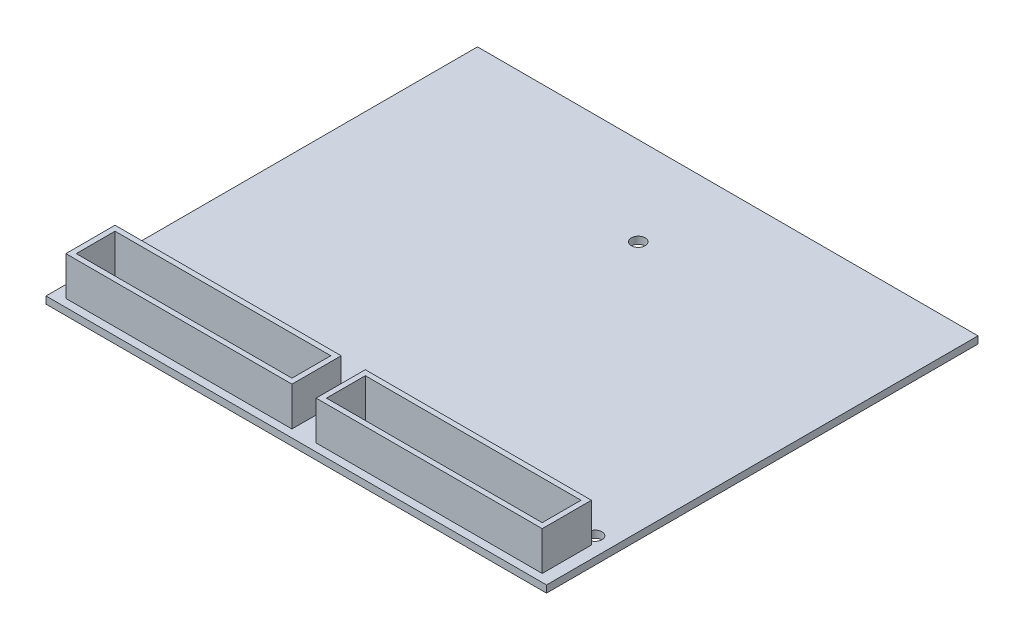
ISO-10303-21;
HEADER;
FILE_DESCRIPTION(('STEP AP214'),'2;1');
FILE_NAME('part.step','',(''),(''),'','','');
FILE_SCHEMA(('AUTOMOTIVE_DESIGN { 1 0 10303 214 1 1 1 1 }'));
ENDSEC;
DATA;
#1=APPLICATION_CONTEXT('core data for automotive mechanical design processes');
#2=APPLICATION_PROTOCOL_DEFINITION('international standard','automotive_design',2000,#1);
#3=PRODUCT_CONTEXT('',#1,'mechanical');
#4=PRODUCT('Part','Part','',(#3));
#5=PRODUCT_RELATED_PRODUCT_CATEGORY('part','',(#4));
#6=PRODUCT_DEFINITION_FORMATION('','',#4);
#7=PRODUCT_DEFINITION_CONTEXT('part definition',#1,'design');
#8=PRODUCT_DEFINITION('design','',#6,#7);
#9=PRODUCT_DEFINITION_SHAPE('','',#8);
#10=(LENGTH_UNIT() NAMED_UNIT(*) SI_UNIT(.MILLI.,.METRE.));
#11=(NAMED_UNIT(*) PLANE_ANGLE_UNIT() SI_UNIT($,.RADIAN.));
#12=(NAMED_UNIT(*) SI_UNIT($,.STERADIAN.) SOLID_ANGLE_UNIT());
#13=UNCERTAINTY_MEASURE_WITH_UNIT(LENGTH_MEASURE(1.E-05),#10,'distance_accuracy_value','');
#14=(GEOMETRIC_REPRESENTATION_CONTEXT(3) GLOBAL_UNCERTAINTY_ASSIGNED_CONTEXT((#13)) GLOBAL_UNIT_ASSIGNED_CONTEXT((#10,
#11,#12)) REPRESENTATION_CONTEXT('',''));
#15=CARTESIAN_POINT('',(0.,0.,0.));
#16=DIRECTION('',(0.,0.,1.));
#17=DIRECTION('',(1.,0.,0.));
#18=AXIS2_PLACEMENT_3D('',#15,#16,#17);
#19=CARTESIAN_POINT('',(0.,1.65,0.));
#20=DIRECTION('',(0.,-1.,0.));
#21=DIRECTION('',(0.,0.,-1.));
#22=AXIS2_PLACEMENT_3D('',#19,#20,#21);
#23=PLANE('',#22);
#24=CARTESIAN_POINT('',(4.,1.65,-15.5));
#25=DIRECTION('',(0.,1.,0.));
#26=DIRECTION('',(0.,0.,1.));
#27=AXIS2_PLACEMENT_3D('',#24,#25,#26);
#28=CIRCLE('',#27,1.6);
#29=CARTESIAN_POINT('',(4.,1.65,-13.9));
#30=VERTEX_POINT('',#29);
#31=EDGE_CURVE('E352',#30,#30,#28,.T.);
#32=ORIENTED_EDGE('',*,*,#31,.F.);
#33=EDGE_LOOP('',(#32));
#34=FACE_BOUND('',#33,.T.);
#35=CARTESIAN_POINT('',(111.75,1.65,-15.5));
#36=DIRECTION('',(0.,1.,0.));
#37=DIRECTION('',(0.,0.,1.));
#38=AXIS2_PLACEMENT_3D('',#35,#36,#37);
#39=CIRCLE('',#38,1.6);
#40=CARTESIAN_POINT('',(111.75,1.65,-13.9));
#41=VERTEX_POINT('',#40);
#42=EDGE_CURVE('E355',#41,#41,#39,.T.);
#43=ORIENTED_EDGE('',*,*,#42,.F.);
#44=EDGE_LOOP('',(#43));
#45=FACE_BOUND('',#44,.T.);
#46=CARTESIAN_POINT('',(57.75,1.65,-79.5));
#47=DIRECTION('',(0.,1.,0.));
#48=DIRECTION('',(0.,0.,1.));
#49=AXIS2_PLACEMENT_3D('',#46,#47,#48);
#50=CIRCLE('',#49,1.6);
#51=CARTESIAN_POINT('',(57.75,1.65,-77.9));
#52=VERTEX_POINT('',#51);
#53=EDGE_CURVE('E361',#52,#52,#50,.T.);
#54=ORIENTED_EDGE('',*,*,#53,.F.);
#55=EDGE_LOOP('',(#54));
#56=FACE_BOUND('',#55,.T.);
#57=DIRECTION('',(0.,0.,1.));
#58=VECTOR('',#57,1.);
#59=CARTESIAN_POINT('',(0.,1.65,0.));
#60=LINE('',#59,#58);
#61=CARTESIAN_POINT('',(0.,1.65,-100.));
#62=VERTEX_POINT('',#61);
#63=CARTESIAN_POINT('',(0.,1.65,0.));
#64=VERTEX_POINT('',#63);
#65=EDGE_CURVE('E365',#62,#64,#60,.T.);
#66=ORIENTED_EDGE('',*,*,#65,.T.);
#67=DIRECTION('',(1.,0.,0.));
#68=VECTOR('',#67,1.);
#69=CARTESIAN_POINT('',(0.,1.65,0.));
#70=LINE('',#69,#68);
#71=CARTESIAN_POINT('',(116.,1.65,0.));
#72=VERTEX_POINT('',#71);
#73=EDGE_CURVE('E368',#64,#72,#70,.T.);
#74=ORIENTED_EDGE('',*,*,#73,.T.);
#75=DIRECTION('',(0.,0.,-1.));
#76=VECTOR('',#75,1.);
#77=CARTESIAN_POINT('',(116.,1.65,0.));
#78=LINE('',#77,#76);
#79=CARTESIAN_POINT('',(116.,1.65,-100.));
#80=VERTEX_POINT('',#79);
#81=EDGE_CURVE('E371',#72,#80,#78,.T.);
#82=ORIENTED_EDGE('',*,*,#81,.T.);
#83=DIRECTION('',(-1.,0.,0.));
#84=VECTOR('',#83,1.);
#85=CARTESIAN_POINT('',(0.,1.65,-100.));
#86=LINE('',#85,#84);
#87=EDGE_CURVE('E373',#80,#62,#86,.T.);
#88=ORIENTED_EDGE('',*,*,#87,.T.);
#89=EDGE_LOOP('',(#66,#74,#82,#88));
#90=FACE_BOUND('',#89,.T.);
#91=DIRECTION('',(0.,0.,1.));
#92=VECTOR('',#91,1.);
#93=CARTESIAN_POINT('',(2.79999999999998,1.65,0.));
#94=LINE('',#93,#92);
#95=CARTESIAN_POINT('',(2.80000000000002,1.65,-13.2));
#96=VERTEX_POINT('',#95);
#97=CARTESIAN_POINT('',(2.79999999999998,1.65,-1.8));
#98=VERTEX_POINT('',#97);
#99=EDGE_CURVE('E319',#96,#98,#94,.T.);
#100=ORIENTED_EDGE('',*,*,#99,.F.);
#101=DIRECTION('',(-1.,0.,0.));
#102=VECTOR('',#101,1.);
#103=CARTESIAN_POINT('',(0.,1.65,-13.2));
#104=LINE('',#103,#102);
#105=CARTESIAN_POINT('',(55.2,1.65,-13.2));
#106=VERTEX_POINT('',#105);
#107=EDGE_CURVE('E324',#106,#96,#104,.T.);
#108=ORIENTED_EDGE('',*,*,#107,.F.);
#109=DIRECTION('',(0.,0.,-1.));
#110=VECTOR('',#109,1.);
#111=CARTESIAN_POINT('',(55.2,1.65,0.));
#112=LINE('',#111,#110);
#113=CARTESIAN_POINT('',(55.2,1.65,-1.8));
#114=VERTEX_POINT('',#113);
#115=EDGE_CURVE('E336',#114,#106,#112,.T.);
#116=ORIENTED_EDGE('',*,*,#115,.F.);
#117=DIRECTION('',(1.,0.,0.));
#118=VECTOR('',#117,1.);
#119=CARTESIAN_POINT('',(0.,1.65,-1.8));
#120=LINE('',#119,#118);
#121=EDGE_CURVE('E333',#98,#114,#120,.T.);
#122=ORIENTED_EDGE('',*,*,#121,.F.);
#123=EDGE_LOOP('',(#100,#108,#116,#122));
#124=FACE_BOUND('',#123,.T.);
#125=DIRECTION('',(0.,0.,1.));
#126=VECTOR('',#125,1.);
#127=CARTESIAN_POINT('',(60.8,1.65,0.));
#128=LINE('',#127,#126);
#129=CARTESIAN_POINT('',(60.8,1.65,-13.2));
#130=VERTEX_POINT('',#129);
#131=CARTESIAN_POINT('',(60.8,1.65,-1.8));
#132=VERTEX_POINT('',#131);
#133=EDGE_CURVE('E238',#130,#132,#128,.T.);
#134=ORIENTED_EDGE('',*,*,#133,.F.);
#135=DIRECTION('',(-1.,0.,0.));
#136=VECTOR('',#135,1.);
#137=CARTESIAN_POINT('',(0.,1.65,-13.2));
#138=LINE('',#137,#136);
#139=CARTESIAN_POINT('',(113.2,1.65,-13.2));
#140=VERTEX_POINT('',#139);
#141=EDGE_CURVE('E266',#140,#130,#138,.T.);
#142=ORIENTED_EDGE('',*,*,#141,.F.);
#143=DIRECTION('',(0.,0.,-1.));
#144=VECTOR('',#143,1.);
#145=CARTESIAN_POINT('',(113.2,1.65,0.));
#146=LINE('',#145,#144);
#147=CARTESIAN_POINT('',(113.2,1.65,-1.8));
#148=VERTEX_POINT('',#147);
#149=EDGE_CURVE('E104',#148,#140,#146,.T.);
#150=ORIENTED_EDGE('',*,*,#149,.F.);
#151=DIRECTION('',(1.,0.,0.));
#152=VECTOR('',#151,1.);
#153=CARTESIAN_POINT('',(0.,1.65,-1.8));
#154=LINE('',#153,#152);
#155=EDGE_CURVE('E99',#132,#148,#154,.T.);
#156=ORIENTED_EDGE('',*,*,#155,.F.);
#157=EDGE_LOOP('',(#134,#142,#150,#156));
#158=FACE_BOUND('',#157,.T.);
#159=ADVANCED_FACE('F82',(#34,#45,#56,#90,#124,#158),#23,.F.);
#160=CARTESIAN_POINT('',(0.,1.65,0.));
#161=DIRECTION('',(1.,0.,0.));
#162=DIRECTION('',(0.,0.,-1.));
#163=AXIS2_PLACEMENT_3D('',#160,#161,#162);
#164=PLANE('',#163);
#165=DIRECTION('',(0.,0.,1.));
#166=VECTOR('',#165,1.);
#167=CARTESIAN_POINT('',(0.,0.,0.));
#168=LINE('',#167,#166);
#169=CARTESIAN_POINT('',(0.,0.,-100.));
#170=VERTEX_POINT('',#169);
#171=CARTESIAN_POINT('',(0.,0.,0.));
#172=VERTEX_POINT('',#171);
#173=EDGE_CURVE('E376',#170,#172,#168,.T.);
#174=ORIENTED_EDGE('',*,*,#173,.T.);
#175=DIRECTION('',(0.,-1.,0.));
#176=VECTOR('',#175,1.);
#177=CARTESIAN_POINT('',(0.,1.65,0.));
#178=LINE('',#177,#176);
#179=EDGE_CURVE('E12',#64,#172,#178,.T.);
#180=ORIENTED_EDGE('',*,*,#179,.F.);
#181=ORIENTED_EDGE('',*,*,#65,.F.);
#182=DIRECTION('',(0.,-1.,0.));
#183=VECTOR('',#182,1.);
#184=CARTESIAN_POINT('',(0.,1.65,-100.));
#185=LINE('',#184,#183);
#186=EDGE_CURVE('E375',#62,#170,#185,.T.);
#187=ORIENTED_EDGE('',*,*,#186,.T.);
#188=EDGE_LOOP('',(#174,#180,#181,#187));
#189=FACE_BOUND('',#188,.T.);
#190=ADVANCED_FACE('F84',(#189),#164,.F.);
#191=CARTESIAN_POINT('',(0.,1.65,0.));
#192=DIRECTION('',(0.,0.,-1.));
#193=DIRECTION('',(-1.,0.,0.));
#194=AXIS2_PLACEMENT_3D('',#191,#192,#193);
#195=PLANE('',#194);
#196=DIRECTION('',(1.,0.,0.));
#197=VECTOR('',#196,1.);
#198=CARTESIAN_POINT('',(0.,0.,0.));
#199=LINE('',#198,#197);
#200=CARTESIAN_POINT('',(116.,0.,0.));
#201=VERTEX_POINT('',#200);
#202=EDGE_CURVE('E379',#172,#201,#199,.T.);
#203=ORIENTED_EDGE('',*,*,#202,.T.);
#204=DIRECTION('',(0.,-1.,0.));
#205=VECTOR('',#204,1.);
#206=CARTESIAN_POINT('',(116.,1.65,0.));
#207=LINE('',#206,#205);
#208=EDGE_CURVE('E91',#72,#201,#207,.T.);
#209=ORIENTED_EDGE('',*,*,#208,.F.);
#210=ORIENTED_EDGE('',*,*,#73,.F.);
#211=ORIENTED_EDGE('',*,*,#179,.T.);
#212=EDGE_LOOP('',(#203,#209,#210,#211));
#213=FACE_BOUND('',#212,.T.);
#214=ADVANCED_FACE('F417',(#213),#195,.F.);
#215=CARTESIAN_POINT('',(116.,1.65,0.));
#216=DIRECTION('',(-1.,0.,0.));
#217=DIRECTION('',(0.,0.,1.));
#218=AXIS2_PLACEMENT_3D('',#215,#216,#217);
#219=PLANE('',#218);
#220=DIRECTION('',(0.,0.,-1.));
#221=VECTOR('',#220,1.);
#222=CARTESIAN_POINT('',(116.,0.,0.));
#223=LINE('',#222,#221);
#224=CARTESIAN_POINT('',(116.,0.,-100.));
#225=VERTEX_POINT('',#224);
#226=EDGE_CURVE('E381',#201,#225,#223,.T.);
#227=ORIENTED_EDGE('',*,*,#226,.T.);
#228=DIRECTION('',(0.,-1.,0.));
#229=VECTOR('',#228,1.);
#230=CARTESIAN_POINT('',(116.,1.65,-100.));
#231=LINE('',#230,#229);
#232=EDGE_CURVE('E386',#80,#225,#231,.T.);
#233=ORIENTED_EDGE('',*,*,#232,.F.);
#234=ORIENTED_EDGE('',*,*,#81,.F.);
#235=ORIENTED_EDGE('',*,*,#208,.T.);
#236=EDGE_LOOP('',(#227,#233,#234,#235));
#237=FACE_BOUND('',#236,.T.);
#238=ADVANCED_FACE('F414',(#237),#219,.F.);
#239=CARTESIAN_POINT('',(0.,1.65,-100.));
#240=DIRECTION('',(0.,0.,1.));
#241=DIRECTION('',(1.,0.,0.));
#242=AXIS2_PLACEMENT_3D('',#239,#240,#241);
#243=PLANE('',#242);
#244=DIRECTION('',(-1.,0.,0.));
#245=VECTOR('',#244,1.);
#246=CARTESIAN_POINT('',(0.,0.,-100.));
#247=LINE('',#246,#245);
#248=EDGE_CURVE('E369',#225,#170,#247,.T.);
#249=ORIENTED_EDGE('',*,*,#248,.T.);
#250=ORIENTED_EDGE('',*,*,#186,.F.);
#251=ORIENTED_EDGE('',*,*,#87,.F.);
#252=ORIENTED_EDGE('',*,*,#232,.T.);
#253=EDGE_LOOP('',(#249,#250,#251,#252));
#254=FACE_BOUND('',#253,.T.);
#255=ADVANCED_FACE('F399',(#254),#243,.F.);
#256=CARTESIAN_POINT('',(0.,0.,0.));
#257=DIRECTION('',(0.,-1.,0.));
#258=DIRECTION('',(0.,0.,-1.));
#259=AXIS2_PLACEMENT_3D('',#256,#257,#258);
#260=PLANE('',#259);
#261=CARTESIAN_POINT('',(4.,0.,-15.5));
#262=DIRECTION('',(0.,-1.,0.));
#263=DIRECTION('',(0.,0.,-1.));
#264=AXIS2_PLACEMENT_3D('',#261,#262,#263);
#265=CIRCLE('',#264,1.6);
#266=CARTESIAN_POINT('',(4.,0.,-17.1));
#267=VERTEX_POINT('',#266);
#268=EDGE_CURVE('E86',#267,#267,#265,.T.);
#269=ORIENTED_EDGE('',*,*,#268,.F.);
#270=EDGE_LOOP('',(#269));
#271=FACE_BOUND('',#270,.T.);
#272=CARTESIAN_POINT('',(111.75,0.,-15.5));
#273=DIRECTION('',(0.,-1.,0.));
#274=DIRECTION('',(0.,0.,-1.));
#275=AXIS2_PLACEMENT_3D('',#272,#273,#274);
#276=CIRCLE('',#275,1.6);
#277=CARTESIAN_POINT('',(111.75,0.,-17.1));
#278=VERTEX_POINT('',#277);
#279=EDGE_CURVE('E358',#278,#278,#276,.T.);
#280=ORIENTED_EDGE('',*,*,#279,.F.);
#281=EDGE_LOOP('',(#280));
#282=FACE_BOUND('',#281,.T.);
#283=CARTESIAN_POINT('',(57.75,0.,-79.5));
#284=DIRECTION('',(0.,-1.,0.));
#285=DIRECTION('',(0.,0.,-1.));
#286=AXIS2_PLACEMENT_3D('',#283,#284,#285);
#287=CIRCLE('',#286,1.6);
#288=CARTESIAN_POINT('',(57.75,0.,-81.1));
#289=VERTEX_POINT('',#288);
#290=EDGE_CURVE('E364',#289,#289,#287,.T.);
#291=ORIENTED_EDGE('',*,*,#290,.F.);
#292=EDGE_LOOP('',(#291));
#293=FACE_BOUND('',#292,.T.);
#294=ORIENTED_EDGE('',*,*,#173,.F.);
#295=ORIENTED_EDGE('',*,*,#248,.F.);
#296=ORIENTED_EDGE('',*,*,#226,.F.);
#297=ORIENTED_EDGE('',*,*,#202,.F.);
#298=EDGE_LOOP('',(#294,#295,#296,#297));
#299=FACE_BOUND('',#298,.T.);
#300=ADVANCED_FACE('F396',(#271,#282,#293,#299),#260,.T.);
#301=CARTESIAN_POINT('',(57.75,1.65,-79.5));
#302=DIRECTION('',(0.,1.,0.));
#303=DIRECTION('',(0.,0.,1.));
#304=AXIS2_PLACEMENT_3D('',#301,#302,#303);
#305=CYLINDRICAL_SURFACE('',#304,1.6);
#306=ORIENTED_EDGE('',*,*,#290,.T.);
#307=EDGE_LOOP('',(#306));
#308=FACE_BOUND('',#307,.T.);
#309=ORIENTED_EDGE('',*,*,#53,.T.);
#310=EDGE_LOOP('',(#309));
#311=FACE_BOUND('',#310,.T.);
#312=ADVANCED_FACE('F393',(#308,#311),#305,.F.);
#313=CARTESIAN_POINT('',(111.75,1.65,-15.5));
#314=DIRECTION('',(0.,1.,0.));
#315=DIRECTION('',(0.,0.,1.));
#316=AXIS2_PLACEMENT_3D('',#313,#314,#315);
#317=CYLINDRICAL_SURFACE('',#316,1.6);
#318=ORIENTED_EDGE('',*,*,#279,.T.);
#319=EDGE_LOOP('',(#318));
#320=FACE_BOUND('',#319,.T.);
#321=ORIENTED_EDGE('',*,*,#42,.T.);
#322=EDGE_LOOP('',(#321));
#323=FACE_BOUND('',#322,.T.);
#324=ADVANCED_FACE('F490',(#320,#323),#317,.F.);
#325=CARTESIAN_POINT('',(4.,1.65,-15.5));
#326=DIRECTION('',(0.,1.,0.));
#327=DIRECTION('',(0.,0.,1.));
#328=AXIS2_PLACEMENT_3D('',#325,#326,#327);
#329=CYLINDRICAL_SURFACE('',#328,1.6);
#330=ORIENTED_EDGE('',*,*,#268,.T.);
#331=EDGE_LOOP('',(#330));
#332=FACE_BOUND('',#331,.T.);
#333=ORIENTED_EDGE('',*,*,#31,.T.);
#334=EDGE_LOOP('',(#333));
#335=FACE_BOUND('',#334,.T.);
#336=ADVANCED_FACE('F472',(#332,#335),#329,.F.);
#337=CARTESIAN_POINT('',(0.,10.65,0.));
#338=DIRECTION('',(0.,1.,0.));
#339=DIRECTION('',(0.,0.,1.));
#340=AXIS2_PLACEMENT_3D('',#337,#338,#339);
#341=PLANE('',#340);
#342=DIRECTION('',(0.,0.,1.));
#343=VECTOR('',#342,1.);
#344=CARTESIAN_POINT('',(2.79999999999998,10.65,0.));
#345=LINE('',#344,#343);
#346=CARTESIAN_POINT('',(2.80000000000002,10.65,-13.2));
#347=VERTEX_POINT('',#346);
#348=CARTESIAN_POINT('',(2.79999999999998,10.65,-1.8));
#349=VERTEX_POINT('',#348);
#350=EDGE_CURVE('E320',#347,#349,#345,.T.);
#351=ORIENTED_EDGE('',*,*,#350,.T.);
#352=DIRECTION('',(1.,0.,0.));
#353=VECTOR('',#352,1.);
#354=CARTESIAN_POINT('',(0.,10.65,-1.8));
#355=LINE('',#354,#353);
#356=CARTESIAN_POINT('',(55.2,10.65,-1.8));
#357=VERTEX_POINT('',#356);
#358=EDGE_CURVE('E323',#349,#357,#355,.T.);
#359=ORIENTED_EDGE('',*,*,#358,.T.);
#360=DIRECTION('',(0.,0.,-1.));
#361=VECTOR('',#360,1.);
#362=CARTESIAN_POINT('',(55.2,10.65,0.));
#363=LINE('',#362,#361);
#364=CARTESIAN_POINT('',(55.2,10.65,-13.2));
#365=VERTEX_POINT('',#364);
#366=EDGE_CURVE('E326',#357,#365,#363,.T.);
#367=ORIENTED_EDGE('',*,*,#366,.T.);
#368=DIRECTION('',(-1.,0.,0.));
#369=VECTOR('',#368,1.);
#370=CARTESIAN_POINT('',(0.,10.65,-13.2));
#371=LINE('',#370,#369);
#372=EDGE_CURVE('E328',#365,#347,#371,.T.);
#373=ORIENTED_EDGE('',*,*,#372,.T.);
#374=EDGE_LOOP('',(#351,#359,#367,#373));
#375=FACE_BOUND('',#374,.T.);
#376=DIRECTION('',(1.,0.,0.));
#377=VECTOR('',#376,1.);
#378=CARTESIAN_POINT('',(3.99999999999999,10.65,-3.));
#379=LINE('',#378,#377);
#380=CARTESIAN_POINT('',(3.99999999999999,10.65,-3.));
#381=VERTEX_POINT('',#380);
#382=CARTESIAN_POINT('',(54.,10.65,-3.));
#383=VERTEX_POINT('',#382);
#384=EDGE_CURVE('E292',#381,#383,#379,.T.);
#385=ORIENTED_EDGE('',*,*,#384,.F.);
#386=DIRECTION('',(0.,0.,1.));
#387=VECTOR('',#386,1.);
#388=CARTESIAN_POINT('',(3.99999999999999,10.65,-3.));
#389=LINE('',#388,#387);
#390=CARTESIAN_POINT('',(4.00000000000001,10.65,-12.));
#391=VERTEX_POINT('',#390);
#392=EDGE_CURVE('E290',#391,#381,#389,.T.);
#393=ORIENTED_EDGE('',*,*,#392,.F.);
#394=DIRECTION('',(-1.,0.,0.));
#395=VECTOR('',#394,1.);
#396=CARTESIAN_POINT('',(4.00000000000001,10.65,-12.));
#397=LINE('',#396,#395);
#398=CARTESIAN_POINT('',(54.,10.65,-12.));
#399=VERTEX_POINT('',#398);
#400=EDGE_CURVE('E298',#399,#391,#397,.T.);
#401=ORIENTED_EDGE('',*,*,#400,.F.);
#402=DIRECTION('',(0.,0.,-1.));
#403=VECTOR('',#402,1.);
#404=CARTESIAN_POINT('',(54.,10.65,-3.));
#405=LINE('',#404,#403);
#406=EDGE_CURVE('E295',#383,#399,#405,.T.);
#407=ORIENTED_EDGE('',*,*,#406,.F.);
#408=EDGE_LOOP('',(#385,#393,#401,#407));
#409=FACE_BOUND('',#408,.T.);
#410=ADVANCED_FACE('F468',(#375,#409),#341,.T.);
#411=CARTESIAN_POINT('',(2.79999999999998,10.65,0.));
#412=DIRECTION('',(1.,0.,0.));
#413=DIRECTION('',(0.,0.,-1.));
#414=AXIS2_PLACEMENT_3D('',#411,#412,#413);
#415=PLANE('',#414);
#416=ORIENTED_EDGE('',*,*,#99,.T.);
#417=DIRECTION('',(0.,-1.,0.));
#418=VECTOR('',#417,1.);
#419=CARTESIAN_POINT('',(2.79999999999998,10.65,-1.8));
#420=LINE('',#419,#418);
#421=EDGE_CURVE('E349',#349,#98,#420,.T.);
#422=ORIENTED_EDGE('',*,*,#421,.F.);
#423=ORIENTED_EDGE('',*,*,#350,.F.);
#424=DIRECTION('',(0.,-1.,0.));
#425=VECTOR('',#424,1.);
#426=CARTESIAN_POINT('',(2.80000000000002,10.65,-13.2));
#427=LINE('',#426,#425);
#428=EDGE_CURVE('E330',#347,#96,#427,.T.);
#429=ORIENTED_EDGE('',*,*,#428,.T.);
#430=EDGE_LOOP('',(#416,#422,#423,#429));
#431=FACE_BOUND('',#430,.T.);
#432=ADVANCED_FACE('F471',(#431),#415,.F.);
#433=CARTESIAN_POINT('',(0.,10.65,-1.8));
#434=DIRECTION('',(0.,0.,-1.));
#435=DIRECTION('',(-1.,0.,0.));
#436=AXIS2_PLACEMENT_3D('',#433,#434,#435);
#437=PLANE('',#436);
#438=ORIENTED_EDGE('',*,*,#121,.T.);
#439=DIRECTION('',(0.,-1.,0.));
#440=VECTOR('',#439,1.);
#441=CARTESIAN_POINT('',(55.2,10.65,-1.8));
#442=LINE('',#441,#440);
#443=EDGE_CURVE('E346',#357,#114,#442,.T.);
#444=ORIENTED_EDGE('',*,*,#443,.F.);
#445=ORIENTED_EDGE('',*,*,#358,.F.);
#446=ORIENTED_EDGE('',*,*,#421,.T.);
#447=EDGE_LOOP('',(#438,#444,#445,#446));
#448=FACE_BOUND('',#447,.T.);
#449=ADVANCED_FACE('F480',(#448),#437,.F.);
#450=CARTESIAN_POINT('',(55.2,10.65,0.));
#451=DIRECTION('',(-1.,0.,0.));
#452=DIRECTION('',(0.,0.,1.));
#453=AXIS2_PLACEMENT_3D('',#450,#451,#452);
#454=PLANE('',#453);
#455=ORIENTED_EDGE('',*,*,#115,.T.);
#456=DIRECTION('',(0.,-1.,0.));
#457=VECTOR('',#456,1.);
#458=CARTESIAN_POINT('',(55.2,10.65,-13.2));
#459=LINE('',#458,#457);
#460=EDGE_CURVE('E343',#365,#106,#459,.T.);
#461=ORIENTED_EDGE('',*,*,#460,.F.);
#462=ORIENTED_EDGE('',*,*,#366,.F.);
#463=ORIENTED_EDGE('',*,*,#443,.T.);
#464=EDGE_LOOP('',(#455,#461,#462,#463));
#465=FACE_BOUND('',#464,.T.);
#466=ADVANCED_FACE('F476',(#465),#454,.F.);
#467=CARTESIAN_POINT('',(0.,10.65,-13.2));
#468=DIRECTION('',(0.,0.,1.));
#469=DIRECTION('',(1.,0.,0.));
#470=AXIS2_PLACEMENT_3D('',#467,#468,#469);
#471=PLANE('',#470);
#472=ORIENTED_EDGE('',*,*,#107,.T.);
#473=ORIENTED_EDGE('',*,*,#428,.F.);
#474=ORIENTED_EDGE('',*,*,#372,.F.);
#475=ORIENTED_EDGE('',*,*,#460,.T.);
#476=EDGE_LOOP('',(#472,#473,#474,#475));
#477=FACE_BOUND('',#476,.T.);
#478=ADVANCED_FACE('F466',(#477),#471,.F.);
#479=CARTESIAN_POINT('',(3.99999999999999,10.65,-3.));
#480=DIRECTION('',(1.,0.,0.));
#481=DIRECTION('',(0.,0.,-1.));
#482=AXIS2_PLACEMENT_3D('',#479,#480,#481);
#483=PLANE('',#482);
#484=DIRECTION('',(0.,0.,1.));
#485=VECTOR('',#484,1.);
#486=CARTESIAN_POINT('',(3.99999999999999,1.65,-3.));
#487=LINE('',#486,#485);
#488=CARTESIAN_POINT('',(4.00000000000001,1.65,-12.));
#489=VERTEX_POINT('',#488);
#490=CARTESIAN_POINT('',(3.99999999999999,1.65,-3.));
#491=VERTEX_POINT('',#490);
#492=EDGE_CURVE('E289',#489,#491,#487,.T.);
#493=ORIENTED_EDGE('',*,*,#492,.F.);
#494=DIRECTION('',(0.,-1.,0.));
#495=VECTOR('',#494,1.);
#496=CARTESIAN_POINT('',(4.00000000000001,10.65,-12.));
#497=LINE('',#496,#495);
#498=EDGE_CURVE('E300',#391,#489,#497,.T.);
#499=ORIENTED_EDGE('',*,*,#498,.F.);
#500=ORIENTED_EDGE('',*,*,#392,.T.);
#501=DIRECTION('',(0.,-1.,0.));
#502=VECTOR('',#501,1.);
#503=CARTESIAN_POINT('',(3.99999999999999,10.65,-3.));
#504=LINE('',#503,#502);
#505=EDGE_CURVE('E316',#381,#491,#504,.T.);
#506=ORIENTED_EDGE('',*,*,#505,.T.);
#507=EDGE_LOOP('',(#493,#499,#500,#506));
#508=FACE_BOUND('',#507,.T.);
#509=ADVANCED_FACE('F462',(#508),#483,.T.);
#510=CARTESIAN_POINT('',(3.99999999999999,10.65,-3.));
#511=DIRECTION('',(0.,0.,-1.));
#512=DIRECTION('',(-1.,0.,0.));
#513=AXIS2_PLACEMENT_3D('',#510,#511,#512);
#514=PLANE('',#513);
#515=DIRECTION('',(1.,0.,0.));
#516=VECTOR('',#515,1.);
#517=CARTESIAN_POINT('',(3.99999999999999,1.65,-3.));
#518=LINE('',#517,#516);
#519=CARTESIAN_POINT('',(54.,1.65,-3.));
#520=VERTEX_POINT('',#519);
#521=EDGE_CURVE('E303',#491,#520,#518,.T.);
#522=ORIENTED_EDGE('',*,*,#521,.F.);
#523=ORIENTED_EDGE('',*,*,#505,.F.);
#524=ORIENTED_EDGE('',*,*,#384,.T.);
#525=DIRECTION('',(0.,-1.,0.));
#526=VECTOR('',#525,1.);
#527=CARTESIAN_POINT('',(54.,10.65,-3.));
#528=LINE('',#527,#526);
#529=EDGE_CURVE('E314',#383,#520,#528,.T.);
#530=ORIENTED_EDGE('',*,*,#529,.T.);
#531=EDGE_LOOP('',(#522,#523,#524,#530));
#532=FACE_BOUND('',#531,.T.);
#533=ADVANCED_FACE('F458',(#532),#514,.T.);
#534=CARTESIAN_POINT('',(54.,10.65,-3.));
#535=DIRECTION('',(-1.,0.,0.));
#536=DIRECTION('',(0.,0.,1.));
#537=AXIS2_PLACEMENT_3D('',#534,#535,#536);
#538=PLANE('',#537);
#539=DIRECTION('',(0.,0.,-1.));
#540=VECTOR('',#539,1.);
#541=CARTESIAN_POINT('',(54.,1.65,-3.));
#542=LINE('',#541,#540);
#543=CARTESIAN_POINT('',(54.,1.65,-12.));
#544=VERTEX_POINT('',#543);
#545=EDGE_CURVE('E306',#520,#544,#542,.T.);
#546=ORIENTED_EDGE('',*,*,#545,.F.);
#547=ORIENTED_EDGE('',*,*,#529,.F.);
#548=ORIENTED_EDGE('',*,*,#406,.T.);
#549=DIRECTION('',(0.,-1.,0.));
#550=VECTOR('',#549,1.);
#551=CARTESIAN_POINT('',(54.,10.65,-12.));
#552=LINE('',#551,#550);
#553=EDGE_CURVE('E312',#399,#544,#552,.T.);
#554=ORIENTED_EDGE('',*,*,#553,.T.);
#555=EDGE_LOOP('',(#546,#547,#548,#554));
#556=FACE_BOUND('',#555,.T.);
#557=ADVANCED_FACE('F454',(#556),#538,.T.);
#558=CARTESIAN_POINT('',(4.00000000000001,10.65,-12.));
#559=DIRECTION('',(0.,0.,1.));
#560=DIRECTION('',(1.,0.,0.));
#561=AXIS2_PLACEMENT_3D('',#558,#559,#560);
#562=PLANE('',#561);
#563=DIRECTION('',(-1.,0.,0.));
#564=VECTOR('',#563,1.);
#565=CARTESIAN_POINT('',(4.00000000000001,1.65,-12.));
#566=LINE('',#565,#564);
#567=EDGE_CURVE('E293',#544,#489,#566,.T.);
#568=ORIENTED_EDGE('',*,*,#567,.F.);
#569=ORIENTED_EDGE('',*,*,#553,.F.);
#570=ORIENTED_EDGE('',*,*,#400,.T.);
#571=ORIENTED_EDGE('',*,*,#498,.T.);
#572=EDGE_LOOP('',(#568,#569,#570,#571));
#573=FACE_BOUND('',#572,.T.);
#574=ADVANCED_FACE('F451',(#573),#562,.T.);
#575=ORIENTED_EDGE('',*,*,#567,.T.);
#576=ORIENTED_EDGE('',*,*,#492,.T.);
#577=ORIENTED_EDGE('',*,*,#521,.T.);
#578=ORIENTED_EDGE('',*,*,#545,.T.);
#579=EDGE_LOOP('',(#575,#576,#577,#578));
#580=FACE_BOUND('',#579,.T.);
#581=ADVANCED_FACE('F424',(#580),#23,.F.);
#582=CARTESIAN_POINT('',(0.,10.65,0.));
#583=DIRECTION('',(0.,1.,0.));
#584=DIRECTION('',(0.,0.,1.));
#585=AXIS2_PLACEMENT_3D('',#582,#583,#584);
#586=PLANE('',#585);
#587=DIRECTION('',(0.,0.,1.));
#588=VECTOR('',#587,1.);
#589=CARTESIAN_POINT('',(60.8,10.65,0.));
#590=LINE('',#589,#588);
#591=CARTESIAN_POINT('',(60.8,10.65,-13.2));
#592=VERTEX_POINT('',#591);
#593=CARTESIAN_POINT('',(60.8,10.65,-1.8));
#594=VERTEX_POINT('',#593);
#595=EDGE_CURVE('E262',#592,#594,#590,.T.);
#596=ORIENTED_EDGE('',*,*,#595,.T.);
#597=DIRECTION('',(1.,0.,0.));
#598=VECTOR('',#597,1.);
#599=CARTESIAN_POINT('',(0.,10.65,-1.8));
#600=LINE('',#599,#598);
#601=CARTESIAN_POINT('',(113.2,10.65,-1.8));
#602=VERTEX_POINT('',#601);
#603=EDGE_CURVE('E265',#594,#602,#600,.T.);
#604=ORIENTED_EDGE('',*,*,#603,.T.);
#605=DIRECTION('',(0.,0.,-1.));
#606=VECTOR('',#605,1.);
#607=CARTESIAN_POINT('',(113.2,10.65,0.));
#608=LINE('',#607,#606);
#609=CARTESIAN_POINT('',(113.2,10.65,-13.2));
#610=VERTEX_POINT('',#609);
#611=EDGE_CURVE('E268',#602,#610,#608,.T.);
#612=ORIENTED_EDGE('',*,*,#611,.T.);
#613=DIRECTION('',(-1.,0.,0.));
#614=VECTOR('',#613,1.);
#615=CARTESIAN_POINT('',(0.,10.65,-13.2));
#616=LINE('',#615,#614);
#617=EDGE_CURVE('E270',#610,#592,#616,.T.);
#618=ORIENTED_EDGE('',*,*,#617,.T.);
#619=EDGE_LOOP('',(#596,#604,#612,#618));
#620=FACE_BOUND('',#619,.T.);
#621=DIRECTION('',(1.,0.,0.));
#622=VECTOR('',#621,1.);
#623=CARTESIAN_POINT('',(62.,10.65,-3.));
#624=LINE('',#623,#622);
#625=CARTESIAN_POINT('',(62.,10.65,-3.));
#626=VERTEX_POINT('',#625);
#627=CARTESIAN_POINT('',(112.,10.65,-3.));
#628=VERTEX_POINT('',#627);
#629=EDGE_CURVE('E230',#626,#628,#624,.T.);
#630=ORIENTED_EDGE('',*,*,#629,.F.);
#631=DIRECTION('',(0.,0.,1.));
#632=VECTOR('',#631,1.);
#633=CARTESIAN_POINT('',(62.,10.65,-3.));
#634=LINE('',#633,#632);
#635=CARTESIAN_POINT('',(62.,10.65,-12.));
#636=VERTEX_POINT('',#635);
#637=EDGE_CURVE('E220',#636,#626,#634,.T.);
#638=ORIENTED_EDGE('',*,*,#637,.F.);
#639=DIRECTION('',(-1.,0.,0.));
#640=VECTOR('',#639,1.);
#641=CARTESIAN_POINT('',(62.,10.65,-12.));
#642=LINE('',#641,#640);
#643=CARTESIAN_POINT('',(112.,10.65,-12.));
#644=VERTEX_POINT('',#643);
#645=EDGE_CURVE('E246',#644,#636,#642,.T.);
#646=ORIENTED_EDGE('',*,*,#645,.F.);
#647=DIRECTION('',(0.,0.,-1.));
#648=VECTOR('',#647,1.);
#649=CARTESIAN_POINT('',(112.,10.65,-3.));
#650=LINE('',#649,#648);
#651=EDGE_CURVE('E244',#628,#644,#650,.T.);
#652=ORIENTED_EDGE('',*,*,#651,.F.);
#653=EDGE_LOOP('',(#630,#638,#646,#652));
#654=FACE_BOUND('',#653,.T.);
#655=ADVANCED_FACE('F242',(#620,#654),#586,.T.);
#656=CARTESIAN_POINT('',(60.8,10.65,0.));
#657=DIRECTION('',(1.,0.,0.));
#658=DIRECTION('',(0.,0.,-1.));
#659=AXIS2_PLACEMENT_3D('',#656,#657,#658);
#660=PLANE('',#659);
#661=ORIENTED_EDGE('',*,*,#133,.T.);
#662=DIRECTION('',(0.,-1.,0.));
#663=VECTOR('',#662,1.);
#664=CARTESIAN_POINT('',(60.8,10.65,-1.8));
#665=LINE('',#664,#663);
#666=EDGE_CURVE('E287',#594,#132,#665,.T.);
#667=ORIENTED_EDGE('',*,*,#666,.F.);
#668=ORIENTED_EDGE('',*,*,#595,.F.);
#669=DIRECTION('',(0.,-1.,0.));
#670=VECTOR('',#669,1.);
#671=CARTESIAN_POINT('',(60.8,10.65,-13.2));
#672=LINE('',#671,#670);
#673=EDGE_CURVE('E272',#592,#130,#672,.T.);
#674=ORIENTED_EDGE('',*,*,#673,.T.);
#675=EDGE_LOOP('',(#661,#667,#668,#674));
#676=FACE_BOUND('',#675,.T.);
#677=ADVANCED_FACE('F433',(#676),#660,.F.);
#678=CARTESIAN_POINT('',(0.,10.65,-1.8));
#679=DIRECTION('',(0.,0.,-1.));
#680=DIRECTION('',(-1.,0.,0.));
#681=AXIS2_PLACEMENT_3D('',#678,#679,#680);
#682=PLANE('',#681);
#683=ORIENTED_EDGE('',*,*,#155,.T.);
#684=DIRECTION('',(0.,-1.,0.));
#685=VECTOR('',#684,1.);
#686=CARTESIAN_POINT('',(113.2,10.65,-1.8));
#687=LINE('',#686,#685);
#688=EDGE_CURVE('E284',#602,#148,#687,.T.);
#689=ORIENTED_EDGE('',*,*,#688,.F.);
#690=ORIENTED_EDGE('',*,*,#603,.F.);
#691=ORIENTED_EDGE('',*,*,#666,.T.);
#692=EDGE_LOOP('',(#683,#689,#690,#691));
#693=FACE_BOUND('',#692,.T.);
#694=ADVANCED_FACE('F440',(#693),#682,.F.);
#695=CARTESIAN_POINT('',(113.2,10.65,0.));
#696=DIRECTION('',(-1.,0.,0.));
#697=DIRECTION('',(0.,0.,1.));
#698=AXIS2_PLACEMENT_3D('',#695,#696,#697);
#699=PLANE('',#698);
#700=ORIENTED_EDGE('',*,*,#149,.T.);
#701=DIRECTION('',(0.,-1.,0.));
#702=VECTOR('',#701,1.);
#703=CARTESIAN_POINT('',(113.2,10.65,-13.2));
#704=LINE('',#703,#702);
#705=EDGE_CURVE('E281',#610,#140,#704,.T.);
#706=ORIENTED_EDGE('',*,*,#705,.F.);
#707=ORIENTED_EDGE('',*,*,#611,.F.);
#708=ORIENTED_EDGE('',*,*,#688,.T.);
#709=EDGE_LOOP('',(#700,#706,#707,#708));
#710=FACE_BOUND('',#709,.T.);
#711=ADVANCED_FACE('F438',(#710),#699,.F.);
#712=CARTESIAN_POINT('',(0.,10.65,-13.2));
#713=DIRECTION('',(0.,0.,1.));
#714=DIRECTION('',(1.,0.,0.));
#715=AXIS2_PLACEMENT_3D('',#712,#713,#714);
#716=PLANE('',#715);
#717=ORIENTED_EDGE('',*,*,#141,.T.);
#718=ORIENTED_EDGE('',*,*,#673,.F.);
#719=ORIENTED_EDGE('',*,*,#617,.F.);
#720=ORIENTED_EDGE('',*,*,#705,.T.);
#721=EDGE_LOOP('',(#717,#718,#719,#720));
#722=FACE_BOUND('',#721,.T.);
#723=ADVANCED_FACE('F429',(#722),#716,.F.);
#724=CARTESIAN_POINT('',(62.,10.65,-3.));
#725=DIRECTION('',(1.,0.,0.));
#726=DIRECTION('',(0.,0.,-1.));
#727=AXIS2_PLACEMENT_3D('',#724,#725,#726);
#728=PLANE('',#727);
#729=DIRECTION('',(0.,0.,1.));
#730=VECTOR('',#729,1.);
#731=CARTESIAN_POINT('',(62.,1.65,-3.));
#732=LINE('',#731,#730);
#733=CARTESIAN_POINT('',(62.,1.65,-12.));
#734=VERTEX_POINT('',#733);
#735=CARTESIAN_POINT('',(62.,1.65,-3.));
#736=VERTEX_POINT('',#735);
#737=EDGE_CURVE('E250',#734,#736,#732,.T.);
#738=ORIENTED_EDGE('',*,*,#737,.F.);
#739=DIRECTION('',(0.,-1.,0.));
#740=VECTOR('',#739,1.);
#741=CARTESIAN_POINT('',(62.,10.65,-12.));
#742=LINE('',#741,#740);
#743=EDGE_CURVE('E226',#636,#734,#742,.T.);
#744=ORIENTED_EDGE('',*,*,#743,.F.);
#745=ORIENTED_EDGE('',*,*,#637,.T.);
#746=DIRECTION('',(0.,-1.,0.));
#747=VECTOR('',#746,1.);
#748=CARTESIAN_POINT('',(62.,10.65,-3.));
#749=LINE('',#748,#747);
#750=EDGE_CURVE('E224',#626,#736,#749,.T.);
#751=ORIENTED_EDGE('',*,*,#750,.T.);
#752=EDGE_LOOP('',(#738,#744,#745,#751));
#753=FACE_BOUND('',#752,.T.);
#754=ADVANCED_FACE('F223',(#753),#728,.T.);
#755=CARTESIAN_POINT('',(62.,10.65,-3.));
#756=DIRECTION('',(0.,0.,-1.));
#757=DIRECTION('',(-1.,0.,0.));
#758=AXIS2_PLACEMENT_3D('',#755,#756,#757);
#759=PLANE('',#758);
#760=DIRECTION('',(1.,0.,0.));
#761=VECTOR('',#760,1.);
#762=CARTESIAN_POINT('',(62.,1.65,-3.));
#763=LINE('',#762,#761);
#764=CARTESIAN_POINT('',(112.,1.65,-3.));
#765=VERTEX_POINT('',#764);
#766=EDGE_CURVE('E237',#736,#765,#763,.T.);
#767=ORIENTED_EDGE('',*,*,#766,.F.);
#768=ORIENTED_EDGE('',*,*,#750,.F.);
#769=ORIENTED_EDGE('',*,*,#629,.T.);
#770=DIRECTION('',(0.,-1.,0.));
#771=VECTOR('',#770,1.);
#772=CARTESIAN_POINT('',(112.,10.65,-3.));
#773=LINE('',#772,#771);
#774=EDGE_CURVE('E239',#628,#765,#773,.T.);
#775=ORIENTED_EDGE('',*,*,#774,.T.);
#776=EDGE_LOOP('',(#767,#768,#769,#775));
#777=FACE_BOUND('',#776,.T.);
#778=ADVANCED_FACE('F234',(#777),#759,.T.);
#779=CARTESIAN_POINT('',(112.,10.65,-3.));
#780=DIRECTION('',(-1.,0.,0.));
#781=DIRECTION('',(0.,0.,1.));
#782=AXIS2_PLACEMENT_3D('',#779,#780,#781);
#783=PLANE('',#782);
#784=DIRECTION('',(0.,0.,-1.));
#785=VECTOR('',#784,1.);
#786=CARTESIAN_POINT('',(112.,1.65,-3.));
#787=LINE('',#786,#785);
#788=CARTESIAN_POINT('',(112.,1.65,-12.));
#789=VERTEX_POINT('',#788);
#790=EDGE_CURVE('E253',#765,#789,#787,.T.);
#791=ORIENTED_EDGE('',*,*,#790,.F.);
#792=ORIENTED_EDGE('',*,*,#774,.F.);
#793=ORIENTED_EDGE('',*,*,#651,.T.);
#794=DIRECTION('',(0.,-1.,0.));
#795=VECTOR('',#794,1.);
#796=CARTESIAN_POINT('',(112.,10.65,-12.));
#797=LINE('',#796,#795);
#798=EDGE_CURVE('E259',#644,#789,#797,.T.);
#799=ORIENTED_EDGE('',*,*,#798,.T.);
#800=EDGE_LOOP('',(#791,#792,#793,#799));
#801=FACE_BOUND('',#800,.T.);
#802=ADVANCED_FACE('F627',(#801),#783,.T.);
#803=CARTESIAN_POINT('',(62.,10.65,-12.));
#804=DIRECTION('',(0.,0.,1.));
#805=DIRECTION('',(1.,0.,0.));
#806=AXIS2_PLACEMENT_3D('',#803,#804,#805);
#807=PLANE('',#806);
#808=DIRECTION('',(-1.,0.,0.));
#809=VECTOR('',#808,1.);
#810=CARTESIAN_POINT('',(62.,1.65,-12.));
#811=LINE('',#810,#809);
#812=EDGE_CURVE('E231',#789,#734,#811,.T.);
#813=ORIENTED_EDGE('',*,*,#812,.F.);
#814=ORIENTED_EDGE('',*,*,#798,.F.);
#815=ORIENTED_EDGE('',*,*,#645,.T.);
#816=ORIENTED_EDGE('',*,*,#743,.T.);
#817=EDGE_LOOP('',(#813,#814,#815,#816));
#818=FACE_BOUND('',#817,.T.);
#819=ADVANCED_FACE('F636',(#818),#807,.T.);
#820=ORIENTED_EDGE('',*,*,#812,.T.);
#821=ORIENTED_EDGE('',*,*,#737,.T.);
#822=ORIENTED_EDGE('',*,*,#766,.T.);
#823=ORIENTED_EDGE('',*,*,#790,.T.);
#824=EDGE_LOOP('',(#820,#821,#822,#823));
#825=FACE_BOUND('',#824,.T.);
#826=ADVANCED_FACE('F423',(#825),#23,.F.);
#827=CLOSED_SHELL('',(#159,#190,#214,#238,#255,#300,#312,#324,#336,#410,#432,#449,#466,#478,
#509,#533,#557,#574,#581,#655,#677,#694,#711,#723,#754,#778,#802,#819,#826));
#828=MANIFOLD_SOLID_BREP('B2',#827);
#829=ADVANCED_BREP_SHAPE_REPRESENTATION('',(#18,#828),#14);
#830=SHAPE_DEFINITION_REPRESENTATION(#9,#829);
ENDSEC;
END-ISO-10303-21;
